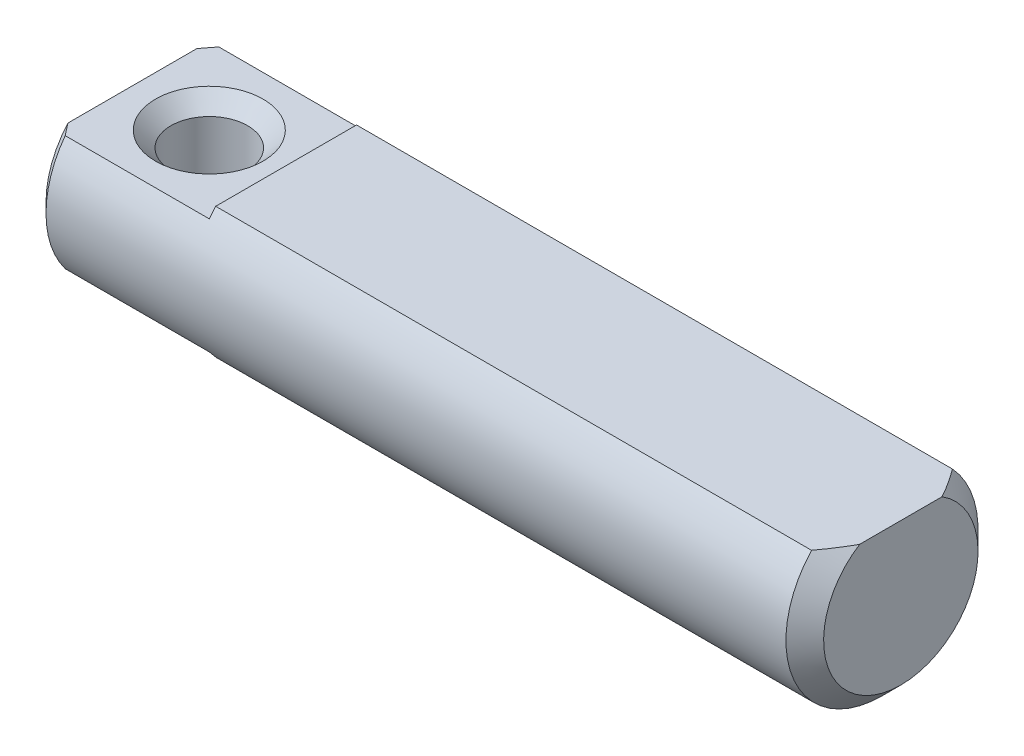
ISO-10303-21;
HEADER;
FILE_DESCRIPTION(('STEP AP214'),'2;1');
FILE_NAME('part.step','',(''),(''),'','','');
FILE_SCHEMA(('AUTOMOTIVE_DESIGN { 1 0 10303 214 1 1 1 1 }'));
ENDSEC;
DATA;
#1=APPLICATION_CONTEXT('core data for automotive mechanical design processes');
#2=APPLICATION_PROTOCOL_DEFINITION('international standard','automotive_design',2000,#1);
#3=PRODUCT_CONTEXT('',#1,'mechanical');
#4=PRODUCT('Part','Part','',(#3));
#5=PRODUCT_RELATED_PRODUCT_CATEGORY('part','',(#4));
#6=PRODUCT_DEFINITION_FORMATION('','',#4);
#7=PRODUCT_DEFINITION_CONTEXT('part definition',#1,'design');
#8=PRODUCT_DEFINITION('design','',#6,#7);
#9=PRODUCT_DEFINITION_SHAPE('','',#8);
#10=(LENGTH_UNIT() NAMED_UNIT(*) SI_UNIT(.MILLI.,.METRE.));
#11=(NAMED_UNIT(*) PLANE_ANGLE_UNIT() SI_UNIT($,.RADIAN.));
#12=(NAMED_UNIT(*) SI_UNIT($,.STERADIAN.) SOLID_ANGLE_UNIT());
#13=UNCERTAINTY_MEASURE_WITH_UNIT(LENGTH_MEASURE(1.E-05),#10,'distance_accuracy_value','');
#14=(GEOMETRIC_REPRESENTATION_CONTEXT(3) GLOBAL_UNCERTAINTY_ASSIGNED_CONTEXT((#13)) GLOBAL_UNIT_ASSIGNED_CONTEXT((#10,
#11,#12)) REPRESENTATION_CONTEXT('',''));
#15=CARTESIAN_POINT('',(0.,0.,0.));
#16=DIRECTION('',(0.,0.,1.));
#17=DIRECTION('',(1.,0.,0.));
#18=AXIS2_PLACEMENT_3D('',#15,#16,#17);
#19=CARTESIAN_POINT('',(4.,1.5,10.));
#20=DIRECTION('',(0.,1.,0.));
#21=DIRECTION('',(0.,0.,1.));
#22=AXIS2_PLACEMENT_3D('',#19,#20,#21);
#23=PLANE('',#22);
#24=CARTESIAN_POINT('',(3.25394765917512,1.5,-5.29560570992018));
#25=CARTESIAN_POINT('',(3.15061705901399,1.5,-5.18820658969195));
#26=CARTESIAN_POINT('',(3.04740418077182,1.5,-5.08069402352702));
#27=CARTESIAN_POINT('',(2.84126987891951,1.5,-4.8653880553017));
#28=CARTESIAN_POINT('',(2.73834845792449,1.5,-4.75759465073803));
#29=CARTESIAN_POINT('',(2.43004329292419,1.5,-4.43364697867497));
#30=CARTESIAN_POINT('',(2.22518396395971,1.5,-4.21699299986279));
#31=CARTESIAN_POINT('',(1.8190752570933,1.5,-3.78327979432691));
#32=CARTESIAN_POINT('',(1.61781043952701,1.5,-3.56623509437756));
#33=CARTESIAN_POINT('',(1.31854881478827,1.5,-3.23828667971137));
#34=CARTESIAN_POINT('',(1.21924054657942,1.5,-3.12858082208435));
#35=CARTESIAN_POINT('',(1.02180393754569,1.5,-2.90811369864987));
#36=CARTESIAN_POINT('',(0.923675571102833,1.5,-2.79735245585083));
#37=CARTESIAN_POINT('',(0.75668186540904,1.5,-2.60607811930749));
#38=CARTESIAN_POINT('',(0.687421922502408,1.5,-2.5259099046565));
#39=CARTESIAN_POINT('',(0.549966565610876,1.5,-2.36465516134928));
#40=CARTESIAN_POINT('',(0.481771218847113,1.5,-2.28356857525822));
#41=CARTESIAN_POINT('',(0.346468493526836,1.5,-2.11985492264141));
#42=CARTESIAN_POINT('',(0.279367631542989,1.5,-2.03722245396501));
#43=CARTESIAN_POINT('',(0.147082520165107,1.5,-1.87045090712276));
#44=CARTESIAN_POINT('',(0.0818979770223252,1.5,-1.78631206308137));
#45=CARTESIAN_POINT('',(-0.0463313053743691,1.5,-1.61535890214829));
#46=CARTESIAN_POINT('',(-0.109354906917876,1.5,-1.52852863031957));
#47=CARTESIAN_POINT('',(-0.231571834674448,1.5,-1.3520772759812));
#48=CARTESIAN_POINT('',(-0.290762111951143,1.5,-1.2624540539402));
#49=CARTESIAN_POINT('',(-0.403090372563433,1.5,-1.07992910258385));
#50=CARTESIAN_POINT('',(-0.456251047155288,1.5,-0.987041513790198));
#51=CARTESIAN_POINT('',(-0.55353841912622,1.5,-0.796653981553213));
#52=CARTESIAN_POINT('',(-0.597681286680317,1.5,-0.699162686771187));
#53=CARTESIAN_POINT('',(-0.653722056609675,1.5,-0.548028196993803));
#54=CARTESIAN_POINT('',(-0.670817840354141,1.5,-0.496323268659353));
#55=CARTESIAN_POINT('',(-0.700531633305269,1.5,-0.391626119819846));
#56=CARTESIAN_POINT('',(-0.713150357837076,1.5,-0.338634106406611));
#57=CARTESIAN_POINT('',(-0.733054292563688,1.5,-0.232037646161262));
#58=CARTESIAN_POINT('',(-0.740377637336461,1.5,-0.178440459717248));
#59=CARTESIAN_POINT('',(-0.749289381913937,1.5,-0.0707675976697928));
#60=CARTESIAN_POINT('',(-0.750878586960882,1.5,-0.0166919903199918));
#61=CARTESIAN_POINT('',(-0.748189711201843,1.5,0.0914656977030103));
#62=CARTESIAN_POINT('',(-0.743894712681139,1.5,0.145547348144254));
#63=CARTESIAN_POINT('',(-0.729751147228815,1.5,0.252974148158174));
#64=CARTESIAN_POINT('',(-0.719901420318252,1.5,0.306319141512193));
#65=CARTESIAN_POINT('',(-0.69523652282679,1.5,0.412272630736602));
#66=CARTESIAN_POINT('',(-0.680382627246129,1.5,0.464871941973343));
#67=CARTESIAN_POINT('',(-0.64655994299561,1.5,0.568710881944679));
#68=CARTESIAN_POINT('',(-0.627590938560353,1.5,0.619950439225824));
#69=CARTESIAN_POINT('',(-0.582508520776881,1.5,0.730427189428488));
#70=CARTESIAN_POINT('',(-0.555722573537001,1.5,0.789387325414159));
#71=CARTESIAN_POINT('',(-0.498575855690733,1.5,0.905563799626095));
#72=CARTESIAN_POINT('',(-0.468213079814171,1.5,0.962779136826091));
#73=CARTESIAN_POINT('',(-0.404710143036368,1.5,1.07577082743633));
#74=CARTESIAN_POINT('',(-0.371565058290674,1.5,1.13154439115731));
#75=CARTESIAN_POINT('',(-0.303163471754128,1.5,1.24178698411758));
#76=CARTESIAN_POINT('',(-0.267906551089997,1.5,1.29625575153703));
#77=CARTESIAN_POINT('',(-0.15893395428687,1.5,1.45916596850059));
#78=CARTESIAN_POINT('',(-0.0827098755891717,1.5,1.56592498003152));
#79=CARTESIAN_POINT('',(0.0737759955774233,1.5,1.77618139123757));
#80=CARTESIAN_POINT('',(0.154032674792566,1.5,1.87968266356164));
#81=CARTESIAN_POINT('',(0.295925841049355,1.5,2.0576210266971));
#82=CARTESIAN_POINT('',(0.356929092573277,1.5,2.13256541352064));
#83=CARTESIAN_POINT('',(0.480100821321712,1.5,2.28149035208888));
#84=CARTESIAN_POINT('',(0.542269319102317,1.5,2.35547088679117));
#85=CARTESIAN_POINT('',(0.730138400330311,1.5,2.5762862859579));
#86=CARTESIAN_POINT('',(0.857185655212938,1.5,2.72197405035615));
#87=CARTESIAN_POINT('',(1.11370762115519,1.5,3.01147689149754));
#88=CARTESIAN_POINT('',(1.24318491329819,1.5,3.15528966578221));
#89=CARTESIAN_POINT('',(1.50369702576591,1.5,3.44147452884148));
#90=CARTESIAN_POINT('',(1.63473172166976,1.5,3.58384673104314));
#91=CARTESIAN_POINT('',(1.88901809132751,1.5,3.85796590528933));
#92=CARTESIAN_POINT('',(2.0121970401215,1.5,3.98978048387991));
#93=CARTESIAN_POINT('',(2.25928709182286,1.5,4.25272725814041));
#94=CARTESIAN_POINT('',(2.38319821270344,1.5,4.38385943690907));
#95=CARTESIAN_POINT('',(2.63133544386559,1.5,4.64533491749967));
#96=CARTESIAN_POINT('',(2.75556045442335,1.5,4.77567926392413));
#97=CARTESIAN_POINT('',(3.00445078330742,1.5,5.03593786079109));
#98=CARTESIAN_POINT('',(3.12911608531041,1.5,5.16585212683949));
#99=CARTESIAN_POINT('',(3.25394765917512,1.5,5.29560570992018));
#100=B_SPLINE_CURVE_WITH_KNOTS('',3,(#24,#25,#26,#27,#28,#29,#30,#31,#32,#33,#34,#35,#36,#37,
#38,#39,#40,#41,#42,#43,#44,#45,#46,#47,#48,#49,#50,#51,#52,#53,#54,#55,#56,#57,#58,#59,#60,#61,
#62,#63,#64,#65,#66,#67,#68,#69,#70,#71,#72,#73,#74,#75,#76,#77,#78,#79,#80,#81,#82,#83,#84,#85,
#86,#87,#88,#89,#90,#91,#92,#93,#94,#95,#96,#97,#98,#99),.UNSPECIFIED.,.F.,.F.,(4,2,2,2,2,2,2,2,
2,2,2,2,2,2,2,2,2,2,2,2,2,2,2,2,2,2,2,2,2,2,2,2,2,2,2,2,2,4),(0.,0.447108613703133,
0.894221226465626,1.7887287656546,2.67670064303383,3.12062914323217,3.56454798740253,
3.88236949475611,4.20021098960279,4.51952730253645,4.83879441014374,5.1606003389033,
5.48265915833043,5.80346266301828,6.12368577329948,6.28689941569172,6.45008696875847,
6.61208729704356,6.7740648748217,6.93650913407904,7.09898732870093,7.26275290885663,
7.42652707772552,7.62064342568051,7.81486912329196,8.00944609630369,8.20406179141883,
8.59740753980426,8.99026653651366,9.28015313371062,9.57004484961485,10.1499089088739,
10.7304282916077,11.3109016043263,11.8521314065164,12.3933745503623,12.9335525857375,
13.4737108005204),.UNSPECIFIED.);
#101=CARTESIAN_POINT('',(0.25,1.5,-2.));
#102=VERTEX_POINT('',#101);
#103=CARTESIAN_POINT('',(0.,1.5,-1.67705098312484));
#104=VERTEX_POINT('',#103);
#105=EDGE_CURVE('E120',#102,#104,#100,.T.);
#106=ORIENTED_EDGE('',*,*,#105,.T.);
#107=DIRECTION('',(0.,0.,-1.));
#108=VECTOR('',#107,1.);
#109=CARTESIAN_POINT('',(0.,1.5,10.));
#110=LINE('',#109,#108);
#111=CARTESIAN_POINT('',(0.,1.5,1.67705098312484));
#112=VERTEX_POINT('',#111);
#113=EDGE_CURVE('E166',#112,#104,#110,.T.);
#114=ORIENTED_EDGE('',*,*,#113,.F.);
#115=CARTESIAN_POINT('',(0.25,1.5,2.));
#116=VERTEX_POINT('',#115);
#117=EDGE_CURVE('E124',#112,#116,#100,.T.);
#118=ORIENTED_EDGE('',*,*,#117,.T.);
#119=DIRECTION('',(-1.,0.,0.));
#120=VECTOR('',#119,1.);
#121=CARTESIAN_POINT('',(20.,1.5,2.));
#122=LINE('',#121,#120);
#123=CARTESIAN_POINT('',(4.,1.5,2.));
#124=VERTEX_POINT('',#123);
#125=EDGE_CURVE('E143',#116,#124,#122,.F.);
#126=ORIENTED_EDGE('',*,*,#125,.T.);
#127=DIRECTION('',(0.,0.,-1.));
#128=VECTOR('',#127,1.);
#129=CARTESIAN_POINT('',(4.,1.5,10.));
#130=LINE('',#129,#128);
#131=CARTESIAN_POINT('',(4.,1.5,-2.));
#132=VERTEX_POINT('',#131);
#133=EDGE_CURVE('E177',#124,#132,#130,.T.);
#134=ORIENTED_EDGE('',*,*,#133,.T.);
#135=DIRECTION('',(-1.,0.,0.));
#136=VECTOR('',#135,1.);
#137=CARTESIAN_POINT('',(20.,1.5,-2.));
#138=LINE('',#137,#136);
#139=EDGE_CURVE('E146',#132,#102,#138,.T.);
#140=ORIENTED_EDGE('',*,*,#139,.T.);
#141=EDGE_LOOP('',(#106,#114,#118,#126,#134,#140));
#142=FACE_BOUND('',#141,.T.);
#143=CARTESIAN_POINT('',(2.,1.5,0.));
#144=DIRECTION('',(0.,1.,0.));
#145=DIRECTION('',(0.,0.,1.));
#146=AXIS2_PLACEMENT_3D('',#143,#144,#145);
#147=CIRCLE('',#146,1.4);
#148=CARTESIAN_POINT('',(2.,1.5,1.4));
#149=VERTEX_POINT('',#148);
#150=EDGE_CURVE('E235',#149,#149,#147,.T.);
#151=ORIENTED_EDGE('',*,*,#150,.F.);
#152=EDGE_LOOP('',(#151));
#153=FACE_BOUND('',#152,.T.);
#154=ADVANCED_FACE('F33',(#142,#153),#23,.T.);
#155=CARTESIAN_POINT('',(4.,-1.5,-10.));
#156=DIRECTION('',(0.,-1.,0.));
#157=DIRECTION('',(0.,0.,-1.));
#158=AXIS2_PLACEMENT_3D('',#155,#156,#157);
#159=PLANE('',#158);
#160=CARTESIAN_POINT('',(3.25394765917512,-1.5,5.29560570992018));
#161=CARTESIAN_POINT('',(3.15061705901399,-1.5,5.18820658969195));
#162=CARTESIAN_POINT('',(3.04740418077182,-1.5,5.08069402352702));
#163=CARTESIAN_POINT('',(2.84126987891951,-1.5,4.8653880553017));
#164=CARTESIAN_POINT('',(2.73834845792449,-1.5,4.75759465073803));
#165=CARTESIAN_POINT('',(2.43004329292419,-1.5,4.43364697867497));
#166=CARTESIAN_POINT('',(2.22518396395971,-1.5,4.21699299986279));
#167=CARTESIAN_POINT('',(1.8190752570933,-1.5,3.78327979432691));
#168=CARTESIAN_POINT('',(1.61781043952701,-1.5,3.56623509437756));
#169=CARTESIAN_POINT('',(1.31854881478827,-1.5,3.23828667971137));
#170=CARTESIAN_POINT('',(1.21924054657942,-1.5,3.12858082208435));
#171=CARTESIAN_POINT('',(1.02180393754569,-1.5,2.90811369864987));
#172=CARTESIAN_POINT('',(0.923675571102832,-1.5,2.79735245585083));
#173=CARTESIAN_POINT('',(0.756681865409038,-1.5,2.60607811930749));
#174=CARTESIAN_POINT('',(0.687421922502407,-1.5,2.52590990465649));
#175=CARTESIAN_POINT('',(0.549966565610874,-1.5,2.36465516134927));
#176=CARTESIAN_POINT('',(0.481771218847112,-1.5,2.28356857525822));
#177=CARTESIAN_POINT('',(0.346468493526835,-1.5,2.1198549226414));
#178=CARTESIAN_POINT('',(0.279367631542988,-1.5,2.03722245396501));
#179=CARTESIAN_POINT('',(0.147082520165106,-1.5,1.87045090712276));
#180=CARTESIAN_POINT('',(0.0818979770223245,-1.5,1.78631206308137));
#181=CARTESIAN_POINT('',(-0.0463313053743694,-1.5,1.61535890214829));
#182=CARTESIAN_POINT('',(-0.109354906917876,-1.5,1.52852863031957));
#183=CARTESIAN_POINT('',(-0.231571834674448,-1.5,1.3520772759812));
#184=CARTESIAN_POINT('',(-0.290762111951143,-1.5,1.2624540539402));
#185=CARTESIAN_POINT('',(-0.403090372563433,-1.5,1.07992910258385));
#186=CARTESIAN_POINT('',(-0.456251047155288,-1.5,0.987041513790199));
#187=CARTESIAN_POINT('',(-0.55353841912622,-1.5,0.796653981553214));
#188=CARTESIAN_POINT('',(-0.597681286680317,-1.5,0.699162686771187));
#189=CARTESIAN_POINT('',(-0.653722056609674,-1.5,0.548028196993803));
#190=CARTESIAN_POINT('',(-0.670817840354141,-1.5,0.496323268659353));
#191=CARTESIAN_POINT('',(-0.700531633305269,-1.5,0.391626119819847));
#192=CARTESIAN_POINT('',(-0.713150357837076,-1.5,0.338634106406612));
#193=CARTESIAN_POINT('',(-0.733054292563688,-1.5,0.232037646161262));
#194=CARTESIAN_POINT('',(-0.740377637336461,-1.5,0.178440459717248));
#195=CARTESIAN_POINT('',(-0.749289381913937,-1.5,0.0707675976697932));
#196=CARTESIAN_POINT('',(-0.750878586960882,-1.5,0.0166919903199923));
#197=CARTESIAN_POINT('',(-0.748189711201843,-1.5,-0.09146569770301));
#198=CARTESIAN_POINT('',(-0.743894712681139,-1.5,-0.145547348144254));
#199=CARTESIAN_POINT('',(-0.729751147228815,-1.5,-0.252974148158174));
#200=CARTESIAN_POINT('',(-0.719901420318252,-1.5,-0.306319141512193));
#201=CARTESIAN_POINT('',(-0.69523652282679,-1.5,-0.412272630736602));
#202=CARTESIAN_POINT('',(-0.680382627246129,-1.5,-0.464871941973343));
#203=CARTESIAN_POINT('',(-0.64655994299561,-1.5,-0.568710881944679));
#204=CARTESIAN_POINT('',(-0.627590938560353,-1.5,-0.619950439225824));
#205=CARTESIAN_POINT('',(-0.582508520776881,-1.5,-0.730427189428487));
#206=CARTESIAN_POINT('',(-0.555722573537001,-1.5,-0.789387325414159));
#207=CARTESIAN_POINT('',(-0.498575855690733,-1.5,-0.905563799626095));
#208=CARTESIAN_POINT('',(-0.468213079814171,-1.5,-0.96277913682609));
#209=CARTESIAN_POINT('',(-0.404710143036368,-1.5,-1.07577082743633));
#210=CARTESIAN_POINT('',(-0.371565058290674,-1.5,-1.13154439115731));
#211=CARTESIAN_POINT('',(-0.303163471754127,-1.5,-1.24178698411758));
#212=CARTESIAN_POINT('',(-0.267906551089996,-1.5,-1.29625575153703));
#213=CARTESIAN_POINT('',(-0.158933954286871,-1.5,-1.45916596850059));
#214=CARTESIAN_POINT('',(-0.0827098755891718,-1.5,-1.56592498003152));
#215=CARTESIAN_POINT('',(0.073775995577423,-1.5,-1.77618139123757));
#216=CARTESIAN_POINT('',(0.154032674792565,-1.5,-1.87968266356164));
#217=CARTESIAN_POINT('',(0.295925841049355,-1.5,-2.0576210266971));
#218=CARTESIAN_POINT('',(0.356929092573277,-1.5,-2.13256541352064));
#219=CARTESIAN_POINT('',(0.480100821321712,-1.5,-2.28149035208888));
#220=CARTESIAN_POINT('',(0.542269319102317,-1.5,-2.35547088679117));
#221=CARTESIAN_POINT('',(0.730138400330311,-1.5,-2.5762862859579));
#222=CARTESIAN_POINT('',(0.857185655212938,-1.5,-2.72197405035615));
#223=CARTESIAN_POINT('',(1.11370762115519,-1.5,-3.01147689149754));
#224=CARTESIAN_POINT('',(1.24318491329818,-1.5,-3.15528966578221));
#225=CARTESIAN_POINT('',(1.50369702576591,-1.5,-3.44147452884148));
#226=CARTESIAN_POINT('',(1.63473172166976,-1.5,-3.58384673104314));
#227=CARTESIAN_POINT('',(1.88901809132751,-1.5,-3.85796590528932));
#228=CARTESIAN_POINT('',(2.0121970401215,-1.5,-3.98978048387991));
#229=CARTESIAN_POINT('',(2.25928709182286,-1.5,-4.25272725814041));
#230=CARTESIAN_POINT('',(2.38319821270344,-1.5,-4.38385943690907));
#231=CARTESIAN_POINT('',(2.63133544386559,-1.5,-4.64533491749967));
#232=CARTESIAN_POINT('',(2.75556045442335,-1.5,-4.77567926392413));
#233=CARTESIAN_POINT('',(3.00445078330742,-1.5,-5.03593786079109));
#234=CARTESIAN_POINT('',(3.12911608531041,-1.5,-5.16585212683949));
#235=CARTESIAN_POINT('',(3.25394765917512,-1.5,-5.29560570992018));
#236=B_SPLINE_CURVE_WITH_KNOTS('',3,(#160,#161,#162,#163,#164,#165,#166,#167,#168,#169,#170,
#171,#172,#173,#174,#175,#176,#177,#178,#179,#180,#181,#182,#183,#184,#185,#186,#187,#188,#189,
#190,#191,#192,#193,#194,#195,#196,#197,#198,#199,#200,#201,#202,#203,#204,#205,#206,#207,#208,
#209,#210,#211,#212,#213,#214,#215,#216,#217,#218,#219,#220,#221,#222,#223,#224,#225,#226,#227,
#228,#229,#230,#231,#232,#233,#234,#235),.UNSPECIFIED.,.F.,.F.,(4,2,2,2,2,2,2,2,2,2,2,2,2,2,2,2,
2,2,2,2,2,2,2,2,2,2,2,2,2,2,2,2,2,2,2,2,2,4),(0.,0.447108613703132,0.894221226465624,
1.7887287656546,2.67670064303383,3.12062914323217,3.56454798740253,3.88236949475611,
4.20021098960279,4.51952730253645,4.83879441014374,5.1606003389033,5.48265915833043,
5.80346266301828,6.12368577329948,6.28689941569171,6.45008696875847,6.61208729704355,
6.7740648748217,6.93650913407904,7.09898732870092,7.26275290885662,7.42652707772551,
7.6206434256805,7.81486912329196,8.00944609630368,8.20406179141882,8.59740753980425,
8.99026653651365,9.28015313371062,9.57004484961485,10.1499089088739,10.7304282916077,
11.3109016043263,11.8521314065164,12.3933745503623,12.9335525857375,13.4737108005204),.UNSPECIFIED.);
#237=CARTESIAN_POINT('',(0.25,-1.5,2.));
#238=VERTEX_POINT('',#237);
#239=CARTESIAN_POINT('',(0.,-1.5,1.67705098312484));
#240=VERTEX_POINT('',#239);
#241=EDGE_CURVE('E157',#238,#240,#236,.T.);
#242=ORIENTED_EDGE('',*,*,#241,.T.);
#243=DIRECTION('',(0.,0.,1.));
#244=VECTOR('',#243,1.);
#245=CARTESIAN_POINT('',(0.,-1.5,-10.));
#246=LINE('',#245,#244);
#247=CARTESIAN_POINT('',(0.,-1.5,-1.67705098312484));
#248=VERTEX_POINT('',#247);
#249=EDGE_CURVE('E187',#248,#240,#246,.T.);
#250=ORIENTED_EDGE('',*,*,#249,.F.);
#251=CARTESIAN_POINT('',(0.25,-1.5,-2.));
#252=VERTEX_POINT('',#251);
#253=EDGE_CURVE('E167',#248,#252,#236,.T.);
#254=ORIENTED_EDGE('',*,*,#253,.T.);
#255=DIRECTION('',(-1.,0.,0.));
#256=VECTOR('',#255,1.);
#257=CARTESIAN_POINT('',(20.,-1.5,-2.));
#258=LINE('',#257,#256);
#259=CARTESIAN_POINT('',(4.,-1.5,-2.));
#260=VERTEX_POINT('',#259);
#261=EDGE_CURVE('E151',#252,#260,#258,.F.);
#262=ORIENTED_EDGE('',*,*,#261,.T.);
#263=DIRECTION('',(0.,0.,1.));
#264=VECTOR('',#263,1.);
#265=CARTESIAN_POINT('',(4.,-1.5,-10.));
#266=LINE('',#265,#264);
#267=CARTESIAN_POINT('',(4.,-1.5,2.));
#268=VERTEX_POINT('',#267);
#269=EDGE_CURVE('E54',#260,#268,#266,.T.);
#270=ORIENTED_EDGE('',*,*,#269,.T.);
#271=DIRECTION('',(-1.,0.,0.));
#272=VECTOR('',#271,1.);
#273=CARTESIAN_POINT('',(20.,-1.5,2.));
#274=LINE('',#273,#272);
#275=EDGE_CURVE('E41',#268,#238,#274,.T.);
#276=ORIENTED_EDGE('',*,*,#275,.T.);
#277=EDGE_LOOP('',(#242,#250,#254,#262,#270,#276));
#278=FACE_BOUND('',#277,.T.);
#279=CARTESIAN_POINT('',(2.,-1.5,0.));
#280=DIRECTION('',(0.,1.,0.));
#281=DIRECTION('',(0.,0.,1.));
#282=AXIS2_PLACEMENT_3D('',#279,#280,#281);
#283=CIRCLE('',#282,1.4);
#284=CARTESIAN_POINT('',(2.,-1.5,1.4));
#285=VERTEX_POINT('',#284);
#286=EDGE_CURVE('E117',#285,#285,#283,.T.);
#287=ORIENTED_EDGE('',*,*,#286,.T.);
#288=EDGE_LOOP('',(#287));
#289=FACE_BOUND('',#288,.T.);
#290=ADVANCED_FACE('F155',(#278,#289),#159,.T.);
#291=CARTESIAN_POINT('',(0.,0.,0.));
#292=DIRECTION('',(1.,0.,0.));
#293=DIRECTION('',(0.,0.,-1.));
#294=AXIS2_PLACEMENT_3D('',#291,#292,#293);
#295=PLANE('',#294);
#296=ORIENTED_EDGE('',*,*,#249,.T.);
#297=CARTESIAN_POINT('',(0.,0.,0.));
#298=DIRECTION('',(-1.,0.,0.));
#299=DIRECTION('',(0.,0.,1.));
#300=AXIS2_PLACEMENT_3D('',#297,#298,#299);
#301=CIRCLE('',#300,2.25);
#302=EDGE_CURVE('E135',#240,#112,#301,.T.);
#303=ORIENTED_EDGE('',*,*,#302,.T.);
#304=ORIENTED_EDGE('',*,*,#113,.T.);
#305=EDGE_CURVE('E136',#104,#248,#301,.T.);
#306=ORIENTED_EDGE('',*,*,#305,.T.);
#307=EDGE_LOOP('',(#296,#303,#304,#306));
#308=FACE_BOUND('',#307,.T.);
#309=ADVANCED_FACE('F35',(#308),#295,.F.);
#310=CARTESIAN_POINT('',(0.25,0.,0.));
#311=DIRECTION('',(1.,0.,0.));
#312=DIRECTION('',(0.,0.,-1.));
#313=AXIS2_PLACEMENT_3D('',#310,#311,#312);
#314=CONICAL_SURFACE('',#313,2.5,0.785398163397448);
#315=ORIENTED_EDGE('',*,*,#241,.F.);
#316=CARTESIAN_POINT('',(0.25,0.,0.));
#317=DIRECTION('',(-1.,0.,0.));
#318=DIRECTION('',(0.,0.,1.));
#319=AXIS2_PLACEMENT_3D('',#316,#317,#318);
#320=CIRCLE('',#319,2.5);
#321=EDGE_CURVE('E122',#238,#116,#320,.T.);
#322=ORIENTED_EDGE('',*,*,#321,.T.);
#323=ORIENTED_EDGE('',*,*,#117,.F.);
#324=ORIENTED_EDGE('',*,*,#302,.F.);
#325=EDGE_LOOP('',(#315,#322,#323,#324));
#326=FACE_BOUND('',#325,.T.);
#327=ADVANCED_FACE('F163',(#326),#314,.T.);
#328=ORIENTED_EDGE('',*,*,#253,.F.);
#329=ORIENTED_EDGE('',*,*,#305,.F.);
#330=ORIENTED_EDGE('',*,*,#105,.F.);
#331=EDGE_CURVE('E132',#102,#252,#320,.T.);
#332=ORIENTED_EDGE('',*,*,#331,.T.);
#333=EDGE_LOOP('',(#328,#329,#330,#332));
#334=FACE_BOUND('',#333,.T.);
#335=ADVANCED_FACE('F248',(#334),#314,.T.);
#336=CARTESIAN_POINT('',(20.,0.,0.));
#337=DIRECTION('',(-1.,0.,0.));
#338=DIRECTION('',(0.,0.,1.));
#339=AXIS2_PLACEMENT_3D('',#336,#337,#338);
#340=CYLINDRICAL_SURFACE('',#339,2.5);
#341=CARTESIAN_POINT('',(19.5095,0.,0.));
#342=DIRECTION('',(-1.,0.,0.));
#343=DIRECTION('',(0.,0.,1.));
#344=AXIS2_PLACEMENT_3D('',#341,#342,#343);
#345=CIRCLE('',#344,2.5);
#346=CARTESIAN_POINT('',(19.5095,1.7,-1.83303027798234));
#347=VERTEX_POINT('',#346);
#348=CARTESIAN_POINT('',(19.5095,1.7,1.83303027798234));
#349=VERTEX_POINT('',#348);
#350=EDGE_CURVE('E116',#347,#349,#345,.T.);
#351=ORIENTED_EDGE('',*,*,#350,.T.);
#352=DIRECTION('',(-1.,0.,0.));
#353=VECTOR('',#352,1.);
#354=CARTESIAN_POINT('',(20.,1.7,1.83303027798234));
#355=LINE('',#354,#353);
#356=CARTESIAN_POINT('',(4.,1.7,1.83303027798234));
#357=VERTEX_POINT('',#356);
#358=EDGE_CURVE('E213',#349,#357,#355,.T.);
#359=ORIENTED_EDGE('',*,*,#358,.T.);
#360=CARTESIAN_POINT('',(4.,0.,0.));
#361=DIRECTION('',(1.,0.,0.));
#362=DIRECTION('',(0.,0.,-1.));
#363=AXIS2_PLACEMENT_3D('',#360,#361,#362);
#364=CIRCLE('',#363,2.5);
#365=EDGE_CURVE('E139',#357,#124,#364,.T.);
#366=ORIENTED_EDGE('',*,*,#365,.T.);
#367=ORIENTED_EDGE('',*,*,#125,.F.);
#368=ORIENTED_EDGE('',*,*,#321,.F.);
#369=ORIENTED_EDGE('',*,*,#275,.F.);
#370=CARTESIAN_POINT('',(4.,0.,0.));
#371=DIRECTION('',(1.,0.,0.));
#372=DIRECTION('',(0.,0.,-1.));
#373=AXIS2_PLACEMENT_3D('',#370,#371,#372);
#374=CIRCLE('',#373,2.5);
#375=EDGE_CURVE('E148',#268,#260,#374,.T.);
#376=ORIENTED_EDGE('',*,*,#375,.T.);
#377=ORIENTED_EDGE('',*,*,#261,.F.);
#378=ORIENTED_EDGE('',*,*,#331,.F.);
#379=ORIENTED_EDGE('',*,*,#139,.F.);
#380=CARTESIAN_POINT('',(4.,1.7,-1.83303027798234));
#381=VERTEX_POINT('',#380);
#382=EDGE_CURVE('E140',#132,#381,#364,.T.);
#383=ORIENTED_EDGE('',*,*,#382,.T.);
#384=DIRECTION('',(-1.,0.,0.));
#385=VECTOR('',#384,1.);
#386=CARTESIAN_POINT('',(20.,1.7,-1.83303027798234));
#387=LINE('',#386,#385);
#388=EDGE_CURVE('E48',#381,#347,#387,.F.);
#389=ORIENTED_EDGE('',*,*,#388,.T.);
#390=EDGE_LOOP('',(#351,#359,#366,#367,#368,#369,#376,#377,#378,#379,#383,#389));
#391=FACE_BOUND('',#390,.T.);
#392=ADVANCED_FACE('F170',(#391),#340,.T.);
#393=CARTESIAN_POINT('',(20.,0.,0.));
#394=DIRECTION('',(-1.,0.,0.));
#395=DIRECTION('',(0.,0.,1.));
#396=AXIS2_PLACEMENT_3D('',#393,#394,#395);
#397=CONICAL_SURFACE('',#396,2.0095,0.785398163397447);
#398=ORIENTED_EDGE('',*,*,#350,.F.);
#399=CARTESIAN_POINT('',(16.4948991490845,1.7,-5.24602921693329));
#400=CARTESIAN_POINT('',(16.667485158182,1.7,-5.06454432091621));
#401=CARTESIAN_POINT('',(16.8396869229529,1.7,-4.8826875687832));
#402=CARTESIAN_POINT('',(17.1829206129149,1.7,-4.51773063698978));
#403=CARTESIAN_POINT('',(17.3539520171319,1.7,-4.33462996777923));
#404=CARTESIAN_POINT('',(17.6963588294731,1.7,-3.96461006338604));
#405=CARTESIAN_POINT('',(17.8677133219737,1.7,-3.77767143736923));
#406=CARTESIAN_POINT('',(18.2077389737617,1.7,-3.40146152440055));
#407=CARTESIAN_POINT('',(18.3764109540938,1.7,-3.21219098393539));
#408=CARTESIAN_POINT('',(18.6703604998281,1.7,-2.87488377930698));
#409=CARTESIAN_POINT('',(18.7965170089145,1.7,-2.72761471835134));
#410=CARTESIAN_POINT('',(19.0451902027156,1.7,-2.42980191668069));
#411=CARTESIAN_POINT('',(19.1677039519672,1.7,-2.27925569572799));
#412=CARTESIAN_POINT('',(19.3467508010272,1.7,-2.04999199923117));
#413=CARTESIAN_POINT('',(19.4055876387134,1.7,-1.97307765332539));
#414=CARTESIAN_POINT('',(19.5212308953778,1.7,-1.81774179375102));
#415=CARTESIAN_POINT('',(19.5780375178082,1.7,-1.73932043232155));
#416=CARTESIAN_POINT('',(19.6888738515151,1.7,-1.580671489381));
#417=CARTESIAN_POINT('',(19.7429069122653,1.7,-1.50044626319256));
#418=CARTESIAN_POINT('',(19.8472501658655,1.7,-1.33762519900515));
#419=CARTESIAN_POINT('',(19.8975616381534,1.7,-1.25503018939004));
#420=CARTESIAN_POINT('',(19.9806570433704,1.7,-1.10852631805854));
#421=CARTESIAN_POINT('',(20.0146146401649,1.7,-1.04529288920323));
#422=CARTESIAN_POINT('',(20.0787704221644,1.7,-0.91696414014678));
#423=CARTESIAN_POINT('',(20.108967712526,1.7,-0.851868381280304));
#424=CARTESIAN_POINT('',(20.1919495013124,1.7,-0.653981930333264));
#425=CARTESIAN_POINT('',(20.2375900615837,1.7,-0.517823869348243));
#426=CARTESIAN_POINT('',(20.2787344658833,1.7,-0.328533437016026));
#427=CARTESIAN_POINT('',(20.2876128345574,1.7,-0.278238082011742));
#428=CARTESIAN_POINT('',(20.3010371502219,1.7,-0.177065365808659));
#429=CARTESIAN_POINT('',(20.3055839197318,1.7,-0.126188116962262));
#430=CARTESIAN_POINT('',(20.3100875458006,1.7,-0.0242948461157493));
#431=CARTESIAN_POINT('',(20.3100503170623,1.7,0.026720912126578));
#432=CARTESIAN_POINT('',(20.3054062625596,1.7,0.128546002901165));
#433=CARTESIAN_POINT('',(20.3007987930523,1.7,0.179355305340679));
#434=CARTESIAN_POINT('',(20.2857652157776,1.7,0.291535110215082));
#435=CARTESIAN_POINT('',(20.274280010674,1.7,0.352763671132215));
#436=CARTESIAN_POINT('',(20.2456680528227,1.7,0.473894943675359));
#437=CARTESIAN_POINT('',(20.2285379131871,1.7,0.533796836234163));
#438=CARTESIAN_POINT('',(20.1894961134698,1.7,0.652354951702234));
#439=CARTESIAN_POINT('',(20.1675593145987,1.7,0.711002776050992));
#440=CARTESIAN_POINT('',(20.1198828155402,1.7,0.826698150939042));
#441=CARTESIAN_POINT('',(20.0941437611293,1.7,0.883745971269756));
#442=CARTESIAN_POINT('',(20.0240077818453,1.7,1.02869535484728));
#443=CARTESIAN_POINT('',(19.9773811410896,1.7,1.1155126657578));
#444=CARTESIAN_POINT('',(19.8789217841728,1.7,1.28616319437213));
#445=CARTESIAN_POINT('',(19.8270852998829,1.7,1.36999419193868));
#446=CARTESIAN_POINT('',(19.7195940054934,1.7,1.53545799308052));
#447=CARTESIAN_POINT('',(19.6639297675897,1.7,1.61708462535194));
#448=CARTESIAN_POINT('',(19.5499330274945,1.7,1.77840408197664));
#449=CARTESIAN_POINT('',(19.491601282233,1.7,1.85809744520944));
#450=CARTESIAN_POINT('',(19.3724549773691,1.7,2.01662127149941));
#451=CARTESIAN_POINT('',(19.3116240236341,1.7,2.09543936080227));
#452=CARTESIAN_POINT('',(19.1884107786429,1.7,2.25185598838661));
#453=CARTESIAN_POINT('',(19.1260284001961,1.7,2.32945445772333));
#454=CARTESIAN_POINT('',(18.9372925322981,1.7,2.56054981245648));
#455=CARTESIAN_POINT('',(18.8091612185998,1.7,2.71259333030085));
#456=CARTESIAN_POINT('',(18.5905526062474,1.7,2.96680615943255));
#457=CARTESIAN_POINT('',(18.5008675545801,1.7,3.06966386502907));
#458=CARTESIAN_POINT('',(18.3204004003106,1.7,3.27441578402268));
#459=CARTESIAN_POINT('',(18.2296182815809,1.7,3.37630998321631));
#460=CARTESIAN_POINT('',(17.9559125657117,1.7,3.68097570054537));
#461=CARTESIAN_POINT('',(17.7717301332202,1.7,3.88261465450005));
#462=CARTESIAN_POINT('',(17.4061068995613,1.7,4.27864565014661));
#463=CARTESIAN_POINT('',(17.2247212885999,1.7,4.4730888633042));
#464=CARTESIAN_POINT('',(16.9516617001048,1.7,4.76369785919833));
#465=CARTESIAN_POINT('',(16.8605115996411,1.7,4.86035663108199));
#466=CARTESIAN_POINT('',(16.6779150012819,1.7,5.05339234564977));
#467=CARTESIAN_POINT('',(16.5864685058395,1.7,5.14976929065391));
#468=CARTESIAN_POINT('',(16.4948991490845,1.7,5.24602921693329));
#469=B_SPLINE_CURVE_WITH_KNOTS('',3,(#399,#400,#401,#402,#403,#404,#405,#406,#407,#408,#409,
#410,#411,#412,#413,#414,#415,#416,#417,#418,#419,#420,#421,#422,#423,#424,#425,#426,#427,#428,
#429,#430,#431,#432,#433,#434,#435,#436,#437,#438,#439,#440,#441,#442,#443,#444,#445,#446,#447,
#448,#449,#450,#451,#452,#453,#454,#455,#456,#457,#458,#459,#460,#461,#462,#463,#464,#465,#466,
#467,#468),.UNSPECIFIED.,.F.,.F.,(4,2,2,2,2,2,2,2,2,2,2,2,2,2,2,2,2,2,2,2,2,2,2,2,2,2,2,2,2,2,2,
2,2,2,4),(0.,0.751341731622847,1.50299860667894,2.26375792703712,3.02427973545187,
3.6059977025409,4.18817238798822,4.47866223901073,4.76912289734319,5.05922410620386,
5.3492251136787,5.56442277064852,5.77967154092708,6.20748851974492,6.36055355290793,
6.51358951502958,6.66642801792332,6.81928805199446,7.00585791864423,7.19253992924388,
7.38022263589153,7.56787350300875,7.86322737008684,8.15879641673155,8.45512150502092,
8.75136302383263,9.05002543997079,9.34870467912265,9.94513116561355,10.3545256071122,
10.7639260742895,11.5831867109286,12.3809128318409,12.7794864090513,13.1780566958897),.UNSPECIFIED.);
#470=CARTESIAN_POINT('',(20.,1.7,-1.07148973396855));
#471=VERTEX_POINT('',#470);
#472=EDGE_CURVE('E104',#347,#471,#469,.T.);
#473=ORIENTED_EDGE('',*,*,#472,.T.);
#474=CARTESIAN_POINT('',(20.,0.,0.));
#475=DIRECTION('',(-1.,0.,0.));
#476=DIRECTION('',(0.,0.,1.));
#477=AXIS2_PLACEMENT_3D('',#474,#475,#476);
#478=CIRCLE('',#477,2.0095);
#479=CARTESIAN_POINT('',(20.,1.7,1.07148973396855));
#480=VERTEX_POINT('',#479);
#481=EDGE_CURVE('E114',#471,#480,#478,.T.);
#482=ORIENTED_EDGE('',*,*,#481,.T.);
#483=EDGE_CURVE('E106',#480,#349,#469,.T.);
#484=ORIENTED_EDGE('',*,*,#483,.T.);
#485=EDGE_LOOP('',(#398,#473,#482,#484));
#486=FACE_BOUND('',#485,.T.);
#487=ADVANCED_FACE('F113',(#486),#397,.T.);
#488=CARTESIAN_POINT('',(20.,2.0095,0.));
#489=DIRECTION('',(-1.,0.,0.));
#490=DIRECTION('',(0.,0.,1.));
#491=AXIS2_PLACEMENT_3D('',#488,#489,#490);
#492=PLANE('',#491);
#493=ORIENTED_EDGE('',*,*,#481,.F.);
#494=DIRECTION('',(0.,0.,1.));
#495=VECTOR('',#494,1.);
#496=CARTESIAN_POINT('',(20.,1.7,-2.5));
#497=LINE('',#496,#495);
#498=EDGE_CURVE('E101',#471,#480,#497,.T.);
#499=ORIENTED_EDGE('',*,*,#498,.T.);
#500=EDGE_LOOP('',(#493,#499));
#501=FACE_BOUND('',#500,.T.);
#502=ADVANCED_FACE('F119',(#501),#492,.F.);
#503=CARTESIAN_POINT('',(4.,1.5,10.));
#504=DIRECTION('',(1.,0.,0.));
#505=DIRECTION('',(0.,0.,-1.));
#506=AXIS2_PLACEMENT_3D('',#503,#504,#505);
#507=PLANE('',#506);
#508=ORIENTED_EDGE('',*,*,#365,.F.);
#509=DIRECTION('',(0.,0.,-1.));
#510=VECTOR('',#509,1.);
#511=CARTESIAN_POINT('',(4.,1.7,10.));
#512=LINE('',#511,#510);
#513=EDGE_CURVE('E11',#357,#381,#512,.T.);
#514=ORIENTED_EDGE('',*,*,#513,.T.);
#515=ORIENTED_EDGE('',*,*,#382,.F.);
#516=ORIENTED_EDGE('',*,*,#133,.F.);
#517=EDGE_LOOP('',(#508,#514,#515,#516));
#518=FACE_BOUND('',#517,.T.);
#519=ADVANCED_FACE('F197',(#518),#507,.F.);
#520=CARTESIAN_POINT('',(4.,-1.5,10.));
#521=DIRECTION('',(1.,0.,0.));
#522=DIRECTION('',(0.,0.,-1.));
#523=AXIS2_PLACEMENT_3D('',#520,#521,#522);
#524=PLANE('',#523);
#525=ORIENTED_EDGE('',*,*,#269,.F.);
#526=ORIENTED_EDGE('',*,*,#375,.F.);
#527=EDGE_LOOP('',(#525,#526));
#528=FACE_BOUND('',#527,.T.);
#529=ADVANCED_FACE('F195',(#528),#524,.F.);
#530=CARTESIAN_POINT('',(2.,1.1,0.));
#531=DIRECTION('',(0.,1.,0.));
#532=DIRECTION('',(0.,0.,1.));
#533=AXIS2_PLACEMENT_3D('',#530,#531,#532);
#534=CONICAL_SURFACE('',#533,1.,0.785398163397448);
#535=ORIENTED_EDGE('',*,*,#150,.T.);
#536=EDGE_LOOP('',(#535));
#537=FACE_BOUND('',#536,.T.);
#538=CARTESIAN_POINT('',(2.,1.1,0.));
#539=DIRECTION('',(0.,1.,0.));
#540=DIRECTION('',(0.,0.,1.));
#541=AXIS2_PLACEMENT_3D('',#538,#539,#540);
#542=CIRCLE('',#541,1.);
#543=CARTESIAN_POINT('',(2.,1.1,1.));
#544=VERTEX_POINT('',#543);
#545=EDGE_CURVE('E238',#544,#544,#542,.T.);
#546=ORIENTED_EDGE('',*,*,#545,.F.);
#547=EDGE_LOOP('',(#546));
#548=FACE_BOUND('',#547,.T.);
#549=ADVANCED_FACE('F225',(#537,#548),#534,.F.);
#550=CARTESIAN_POINT('',(2.,-1.5,0.));
#551=DIRECTION('',(0.,1.,0.));
#552=DIRECTION('',(0.,0.,1.));
#553=AXIS2_PLACEMENT_3D('',#550,#551,#552);
#554=CYLINDRICAL_SURFACE('',#553,1.);
#555=ORIENTED_EDGE('',*,*,#545,.T.);
#556=EDGE_LOOP('',(#555));
#557=FACE_BOUND('',#556,.T.);
#558=CARTESIAN_POINT('',(2.,-1.1,0.));
#559=DIRECTION('',(0.,1.,0.));
#560=DIRECTION('',(0.,0.,1.));
#561=AXIS2_PLACEMENT_3D('',#558,#559,#560);
#562=CIRCLE('',#561,1.);
#563=CARTESIAN_POINT('',(2.,-1.1,1.));
#564=VERTEX_POINT('',#563);
#565=EDGE_CURVE('E239',#564,#564,#562,.T.);
#566=ORIENTED_EDGE('',*,*,#565,.F.);
#567=EDGE_LOOP('',(#566));
#568=FACE_BOUND('',#567,.T.);
#569=ADVANCED_FACE('F222',(#557,#568),#554,.F.);
#570=CARTESIAN_POINT('',(2.,-1.5,0.));
#571=DIRECTION('',(0.,-1.,0.));
#572=DIRECTION('',(0.,0.,-1.));
#573=AXIS2_PLACEMENT_3D('',#570,#571,#572);
#574=CONICAL_SURFACE('',#573,1.4,0.785398163397448);
#575=ORIENTED_EDGE('',*,*,#565,.T.);
#576=EDGE_LOOP('',(#575));
#577=FACE_BOUND('',#576,.T.);
#578=ORIENTED_EDGE('',*,*,#286,.F.);
#579=EDGE_LOOP('',(#578));
#580=FACE_BOUND('',#579,.T.);
#581=ADVANCED_FACE('F219',(#577,#580),#574,.F.);
#582=CARTESIAN_POINT('',(0.,1.7,-2.5));
#583=DIRECTION('',(0.,-1.,0.));
#584=DIRECTION('',(0.,0.,-1.));
#585=AXIS2_PLACEMENT_3D('',#582,#583,#584);
#586=PLANE('',#585);
#587=ORIENTED_EDGE('',*,*,#388,.F.);
#588=ORIENTED_EDGE('',*,*,#513,.F.);
#589=ORIENTED_EDGE('',*,*,#358,.F.);
#590=ORIENTED_EDGE('',*,*,#483,.F.);
#591=ORIENTED_EDGE('',*,*,#498,.F.);
#592=ORIENTED_EDGE('',*,*,#472,.F.);
#593=EDGE_LOOP('',(#587,#588,#589,#590,#591,#592));
#594=FACE_BOUND('',#593,.T.);
#595=ADVANCED_FACE('F103',(#594),#586,.F.);
#596=CLOSED_SHELL('',(#154,#290,#309,#327,#335,#392,#487,#502,#519,#529,#549,#569,#581,#595));
#597=MANIFOLD_SOLID_BREP('B2',#596);
#598=ADVANCED_BREP_SHAPE_REPRESENTATION('',(#18,#597),#14);
#599=SHAPE_DEFINITION_REPRESENTATION(#9,#598);
ENDSEC;
END-ISO-10303-21;
